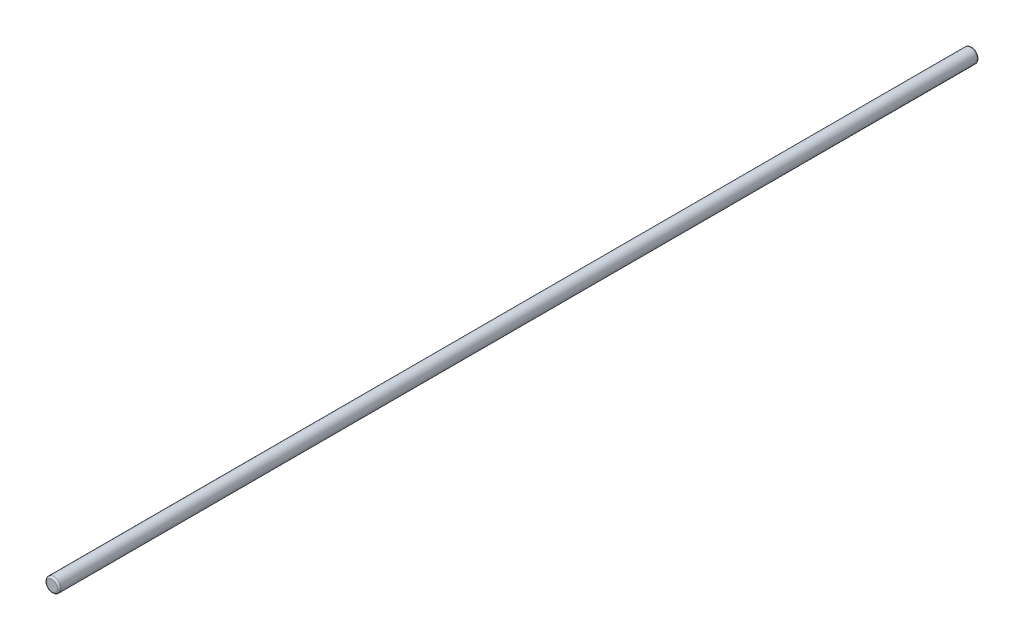
ISO-10303-21;
HEADER;
FILE_DESCRIPTION(('STEP AP214'),'2;1');
FILE_NAME('part.step','',(''),(''),'','','');
FILE_SCHEMA(('AUTOMOTIVE_DESIGN { 1 0 10303 214 1 1 1 1 }'));
ENDSEC;
DATA;
#1=APPLICATION_CONTEXT('core data for automotive mechanical design processes');
#2=APPLICATION_PROTOCOL_DEFINITION('international standard','automotive_design',2000,#1);
#3=PRODUCT_CONTEXT('',#1,'mechanical');
#4=PRODUCT('Part','Part','',(#3));
#5=PRODUCT_RELATED_PRODUCT_CATEGORY('part','',(#4));
#6=PRODUCT_DEFINITION_FORMATION('','',#4);
#7=PRODUCT_DEFINITION_CONTEXT('part definition',#1,'design');
#8=PRODUCT_DEFINITION('design','',#6,#7);
#9=PRODUCT_DEFINITION_SHAPE('','',#8);
#10=(LENGTH_UNIT() NAMED_UNIT(*) SI_UNIT(.MILLI.,.METRE.));
#11=(NAMED_UNIT(*) PLANE_ANGLE_UNIT() SI_UNIT($,.RADIAN.));
#12=(NAMED_UNIT(*) SI_UNIT($,.STERADIAN.) SOLID_ANGLE_UNIT());
#13=UNCERTAINTY_MEASURE_WITH_UNIT(LENGTH_MEASURE(1.E-05),#10,'distance_accuracy_value','');
#14=(GEOMETRIC_REPRESENTATION_CONTEXT(3) GLOBAL_UNCERTAINTY_ASSIGNED_CONTEXT((#13)) GLOBAL_UNIT_ASSIGNED_CONTEXT((#10,
#11,#12)) REPRESENTATION_CONTEXT('',''));
#15=CARTESIAN_POINT('',(0.,0.,0.));
#16=DIRECTION('',(0.,0.,1.));
#17=DIRECTION('',(1.,0.,0.));
#18=AXIS2_PLACEMENT_3D('',#15,#16,#17);
#19=CARTESIAN_POINT('',(0.,0.,520.));
#20=DIRECTION('',(0.,0.,-1.));
#21=DIRECTION('',(-1.,0.,0.));
#22=AXIS2_PLACEMENT_3D('',#19,#20,#21);
#23=CYLINDRICAL_SURFACE('',#22,4.);
#24=CARTESIAN_POINT('',(0.,0.,1.));
#25=DIRECTION('',(0.,0.,1.));
#26=DIRECTION('',(1.,0.,0.));
#27=AXIS2_PLACEMENT_3D('',#24,#25,#26);
#28=CIRCLE('',#27,4.);
#29=CARTESIAN_POINT('',(4.,0.,1.));
#30=VERTEX_POINT('',#29);
#31=EDGE_CURVE('E38',#30,#30,#28,.T.);
#32=ORIENTED_EDGE('',*,*,#31,.T.);
#33=EDGE_LOOP('',(#32));
#34=FACE_BOUND('',#33,.T.);
#35=CARTESIAN_POINT('',(0.,0.,519.));
#36=DIRECTION('',(0.,0.,1.));
#37=DIRECTION('',(1.,0.,0.));
#38=AXIS2_PLACEMENT_3D('',#35,#36,#37);
#39=CIRCLE('',#38,4.);
#40=CARTESIAN_POINT('',(4.,0.,519.));
#41=VERTEX_POINT('',#40);
#42=EDGE_CURVE('E42',#41,#41,#39,.F.);
#43=ORIENTED_EDGE('',*,*,#42,.T.);
#44=EDGE_LOOP('',(#43));
#45=FACE_BOUND('',#44,.T.);
#46=ADVANCED_FACE('F31',(#34,#45),#23,.T.);
#47=CARTESIAN_POINT('',(0.,0.,520.));
#48=DIRECTION('',(0.,0.,1.));
#49=DIRECTION('',(1.,0.,0.));
#50=AXIS2_PLACEMENT_3D('',#47,#48,#49);
#51=PLANE('',#50);
#52=CARTESIAN_POINT('',(0.,0.,520.));
#53=DIRECTION('',(0.,0.,1.));
#54=DIRECTION('',(1.,0.,0.));
#55=AXIS2_PLACEMENT_3D('',#52,#53,#54);
#56=CIRCLE('',#55,3.);
#57=CARTESIAN_POINT('',(3.,0.,520.));
#58=VERTEX_POINT('',#57);
#59=EDGE_CURVE('E46',#58,#58,#56,.T.);
#60=ORIENTED_EDGE('',*,*,#59,.T.);
#61=EDGE_LOOP('',(#60));
#62=FACE_BOUND('',#61,.T.);
#63=ADVANCED_FACE('F52',(#62),#51,.T.);
#64=CARTESIAN_POINT('',(0.,0.,0.));
#65=DIRECTION('',(0.,0.,1.));
#66=DIRECTION('',(1.,0.,0.));
#67=AXIS2_PLACEMENT_3D('',#64,#65,#66);
#68=PLANE('',#67);
#69=CARTESIAN_POINT('',(0.,0.,0.));
#70=DIRECTION('',(0.,0.,1.));
#71=DIRECTION('',(1.,0.,0.));
#72=AXIS2_PLACEMENT_3D('',#69,#70,#71);
#73=CIRCLE('',#72,3.);
#74=CARTESIAN_POINT('',(3.,0.,0.));
#75=VERTEX_POINT('',#74);
#76=EDGE_CURVE('E10',#75,#75,#73,.F.);
#77=ORIENTED_EDGE('',*,*,#76,.T.);
#78=EDGE_LOOP('',(#77));
#79=FACE_BOUND('',#78,.T.);
#80=ADVANCED_FACE('F56',(#79),#68,.F.);
#81=CARTESIAN_POINT('',(0.,0.,519.));
#82=DIRECTION('',(0.,0.,1.));
#83=DIRECTION('',(1.,0.,0.));
#84=AXIS2_PLACEMENT_3D('',#81,#82,#83);
#85=TOROIDAL_SURFACE('',#84,3.,1.);
#86=ORIENTED_EDGE('',*,*,#42,.F.);
#87=EDGE_LOOP('',(#86));
#88=FACE_BOUND('',#87,.T.);
#89=ORIENTED_EDGE('',*,*,#59,.F.);
#90=EDGE_LOOP('',(#89));
#91=FACE_BOUND('',#90,.T.);
#92=ADVANCED_FACE('F54',(#88,#91),#85,.T.);
#93=CARTESIAN_POINT('',(0.,0.,1.));
#94=DIRECTION('',(0.,0.,1.));
#95=DIRECTION('',(1.,0.,0.));
#96=AXIS2_PLACEMENT_3D('',#93,#94,#95);
#97=TOROIDAL_SURFACE('',#96,3.,1.);
#98=ORIENTED_EDGE('',*,*,#76,.F.);
#99=EDGE_LOOP('',(#98));
#100=FACE_BOUND('',#99,.T.);
#101=ORIENTED_EDGE('',*,*,#31,.F.);
#102=EDGE_LOOP('',(#101));
#103=FACE_BOUND('',#102,.T.);
#104=ADVANCED_FACE('F33',(#100,#103),#97,.T.);
#105=CLOSED_SHELL('',(#46,#63,#80,#92,#104));
#106=MANIFOLD_SOLID_BREP('B2',#105);
#107=ADVANCED_BREP_SHAPE_REPRESENTATION('',(#18,#106),#14);
#108=SHAPE_DEFINITION_REPRESENTATION(#9,#107);
ENDSEC;
END-ISO-10303-21;
